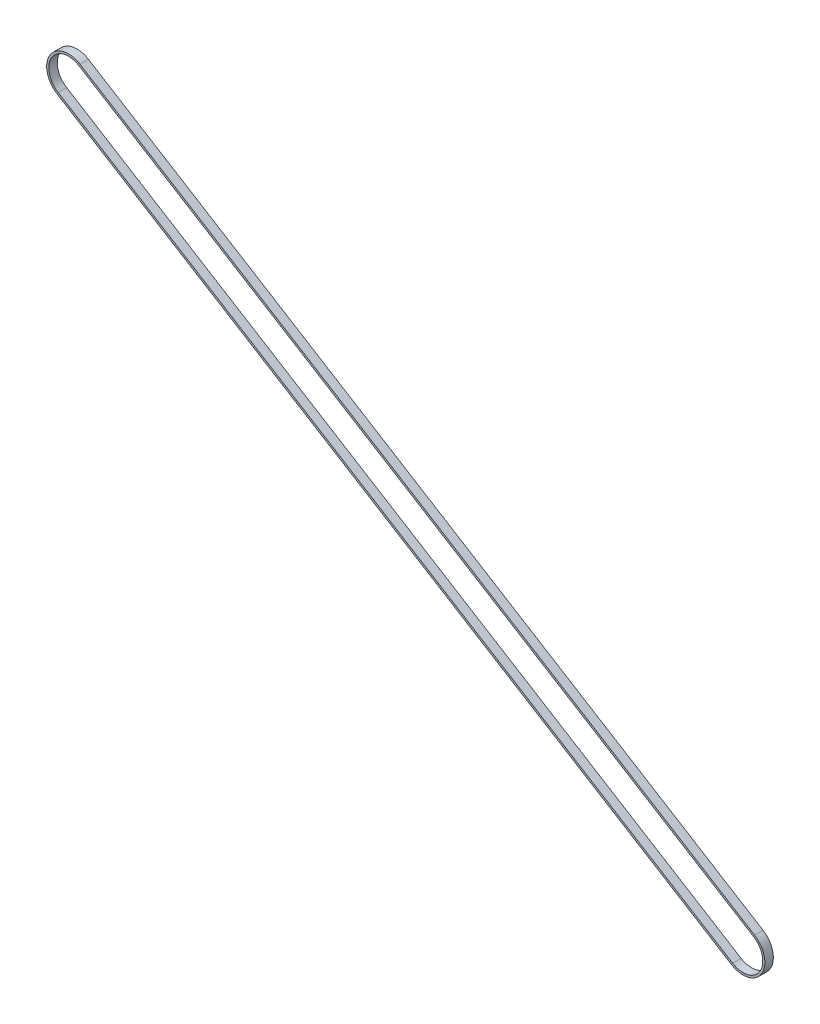
ISO-10303-21;
HEADER;
FILE_DESCRIPTION(('STEP AP214'),'2;1');
FILE_NAME('part.step','',(''),(''),'','','');
FILE_SCHEMA(('AUTOMOTIVE_DESIGN { 1 0 10303 214 1 1 1 1 }'));
ENDSEC;
DATA;
#1=APPLICATION_CONTEXT('core data for automotive mechanical design processes');
#2=APPLICATION_PROTOCOL_DEFINITION('international standard','automotive_design',2000,#1);
#3=PRODUCT_CONTEXT('',#1,'mechanical');
#4=PRODUCT('Part','Part','',(#3));
#5=PRODUCT_RELATED_PRODUCT_CATEGORY('part','',(#4));
#6=PRODUCT_DEFINITION_FORMATION('','',#4);
#7=PRODUCT_DEFINITION_CONTEXT('part definition',#1,'design');
#8=PRODUCT_DEFINITION('design','',#6,#7);
#9=PRODUCT_DEFINITION_SHAPE('','',#8);
#10=(LENGTH_UNIT() NAMED_UNIT(*) SI_UNIT(.MILLI.,.METRE.));
#11=(NAMED_UNIT(*) PLANE_ANGLE_UNIT() SI_UNIT($,.RADIAN.));
#12=(NAMED_UNIT(*) SI_UNIT($,.STERADIAN.) SOLID_ANGLE_UNIT());
#13=UNCERTAINTY_MEASURE_WITH_UNIT(LENGTH_MEASURE(1.E-05),#10,'distance_accuracy_value','');
#14=(GEOMETRIC_REPRESENTATION_CONTEXT(3) GLOBAL_UNCERTAINTY_ASSIGNED_CONTEXT((#13)) GLOBAL_UNIT_ASSIGNED_CONTEXT((#10,
#11,#12)) REPRESENTATION_CONTEXT('',''));
#15=CARTESIAN_POINT('',(0.,0.,0.));
#16=DIRECTION('',(0.,0.,1.));
#17=DIRECTION('',(1.,0.,0.));
#18=AXIS2_PLACEMENT_3D('',#15,#16,#17);
#19=CARTESIAN_POINT('',(-477.919408312635,295.355297509359,6.));
#20=DIRECTION('',(0.,0.,-1.));
#21=DIRECTION('',(-1.,0.,0.));
#22=AXIS2_PLACEMENT_3D('',#19,#20,#21);
#23=CYLINDRICAL_SURFACE('',#22,15.475);
#24=CARTESIAN_POINT('',(-477.919408312635,295.355297509359,0.));
#25=DIRECTION('',(0.,0.,-1.));
#26=DIRECTION('',(-1.,0.,0.));
#27=AXIS2_PLACEMENT_3D('',#24,#25,#26);
#28=CIRCLE('',#27,15.475);
#29=CARTESIAN_POINT('',(-486.054795496159,282.191289746746,0.));
#30=VERTEX_POINT('',#29);
#31=CARTESIAN_POINT('',(-469.78402112911,308.519305271972,0.));
#32=VERTEX_POINT('',#31);
#33=EDGE_CURVE('E159',#30,#32,#28,.T.);
#34=ORIENTED_EDGE('',*,*,#33,.F.);
#35=DIRECTION('',(0.,0.,-1.));
#36=VECTOR('',#35,1.);
#37=CARTESIAN_POINT('',(-486.054795496159,282.191289746746,6.));
#38=LINE('',#37,#36);
#39=CARTESIAN_POINT('',(-486.054795496159,282.191289746746,6.));
#40=VERTEX_POINT('',#39);
#41=EDGE_CURVE('E12',#40,#30,#38,.T.);
#42=ORIENTED_EDGE('',*,*,#41,.F.);
#43=CARTESIAN_POINT('',(-477.919408312635,295.355297509359,6.));
#44=DIRECTION('',(0.,0.,-1.));
#45=DIRECTION('',(-1.,0.,0.));
#46=AXIS2_PLACEMENT_3D('',#43,#44,#45);
#47=CIRCLE('',#46,15.475);
#48=CARTESIAN_POINT('',(-469.78402112911,308.519305271972,6.));
#49=VERTEX_POINT('',#48);
#50=EDGE_CURVE('E163',#40,#49,#47,.T.);
#51=ORIENTED_EDGE('',*,*,#50,.T.);
#52=DIRECTION('',(0.,0.,-1.));
#53=VECTOR('',#52,1.);
#54=CARTESIAN_POINT('',(-469.78402112911,308.519305271972,6.));
#55=LINE('',#54,#53);
#56=EDGE_CURVE('E64',#49,#32,#55,.T.);
#57=ORIENTED_EDGE('',*,*,#56,.T.);
#58=EDGE_LOOP('',(#34,#42,#51,#57));
#59=FACE_BOUND('',#58,.T.);
#60=ADVANCED_FACE('F61',(#59),#23,.T.);
#61=CARTESIAN_POINT('',(-486.054795496159,282.191289746746,6.));
#62=DIRECTION('',(-0.525711611213227,-0.8506628602658,0.));
#63=DIRECTION('',(0.850662860265801,-0.525711611213227,0.));
#64=AXIS2_PLACEMENT_3D('',#61,#62,#63);
#65=PLANE('',#64);
#66=DIRECTION('',(-0.850662860265801,0.525711611213227,0.));
#67=VECTOR('',#66,1.);
#68=CARTESIAN_POINT('',(-486.054795496159,282.191289746746,0.));
#69=LINE('',#68,#67);
#70=CARTESIAN_POINT('',(-8.13538718354534,-13.1640077627645,0.));
#71=VERTEX_POINT('',#70);
#72=EDGE_CURVE('E167',#71,#30,#69,.T.);
#73=ORIENTED_EDGE('',*,*,#72,.F.);
#74=DIRECTION('',(0.,0.,-1.));
#75=VECTOR('',#74,1.);
#76=CARTESIAN_POINT('',(-8.13538718354534,-13.1640077627645,6.));
#77=LINE('',#76,#75);
#78=CARTESIAN_POINT('',(-8.13538718354534,-13.1640077627645,6.));
#79=VERTEX_POINT('',#78);
#80=EDGE_CURVE('E69',#79,#71,#77,.T.);
#81=ORIENTED_EDGE('',*,*,#80,.F.);
#82=DIRECTION('',(-0.850662860265801,0.525711611213227,0.));
#83=VECTOR('',#82,1.);
#84=CARTESIAN_POINT('',(-486.054795496159,282.191289746746,6.));
#85=LINE('',#84,#83);
#86=EDGE_CURVE('E173',#79,#40,#85,.T.);
#87=ORIENTED_EDGE('',*,*,#86,.T.);
#88=ORIENTED_EDGE('',*,*,#41,.T.);
#89=EDGE_LOOP('',(#73,#81,#87,#88));
#90=FACE_BOUND('',#89,.T.);
#91=ADVANCED_FACE('F199',(#90),#65,.T.);
#92=CARTESIAN_POINT('',(-2.06501482580279E-11,-1.51267887105178E-10,6.));
#93=DIRECTION('',(0.,0.,-1.));
#94=DIRECTION('',(-1.,0.,0.));
#95=AXIS2_PLACEMENT_3D('',#92,#93,#94);
#96=CYLINDRICAL_SURFACE('',#95,15.475);
#97=CARTESIAN_POINT('',(-2.06501482580279E-11,-1.51267887105178E-10,0.));
#98=DIRECTION('',(0.,0.,-1.));
#99=DIRECTION('',(-1.,0.,0.));
#100=AXIS2_PLACEMENT_3D('',#97,#98,#99);
#101=CIRCLE('',#100,15.475);
#102=CARTESIAN_POINT('',(8.1353871835041,13.164007762462,0.));
#103=VERTEX_POINT('',#102);
#104=EDGE_CURVE('E181',#103,#71,#101,.T.);
#105=ORIENTED_EDGE('',*,*,#104,.F.);
#106=DIRECTION('',(0.,0.,-1.));
#107=VECTOR('',#106,1.);
#108=CARTESIAN_POINT('',(8.1353871835041,13.164007762462,6.));
#109=LINE('',#108,#107);
#110=CARTESIAN_POINT('',(8.1353871835041,13.164007762462,6.));
#111=VERTEX_POINT('',#110);
#112=EDGE_CURVE('E186',#111,#103,#109,.T.);
#113=ORIENTED_EDGE('',*,*,#112,.F.);
#114=CARTESIAN_POINT('',(-2.06501482580279E-11,-1.51267887105178E-10,6.));
#115=DIRECTION('',(0.,0.,-1.));
#116=DIRECTION('',(-1.,0.,0.));
#117=AXIS2_PLACEMENT_3D('',#114,#115,#116);
#118=CIRCLE('',#117,15.475);
#119=EDGE_CURVE('E170',#111,#79,#118,.T.);
#120=ORIENTED_EDGE('',*,*,#119,.T.);
#121=ORIENTED_EDGE('',*,*,#80,.T.);
#122=EDGE_LOOP('',(#105,#113,#120,#121));
#123=FACE_BOUND('',#122,.T.);
#124=ADVANCED_FACE('F203',(#123),#96,.T.);
#125=CARTESIAN_POINT('',(-469.78402112911,308.519305271972,6.));
#126=DIRECTION('',(0.525711611213227,0.8506628602658,0.));
#127=DIRECTION('',(-0.850662860265801,0.525711611213227,0.));
#128=AXIS2_PLACEMENT_3D('',#125,#126,#127);
#129=PLANE('',#128);
#130=DIRECTION('',(0.850662860265801,-0.525711611213227,0.));
#131=VECTOR('',#130,1.);
#132=CARTESIAN_POINT('',(-469.78402112911,308.519305271972,0.));
#133=LINE('',#132,#131);
#134=EDGE_CURVE('E178',#32,#103,#133,.T.);
#135=ORIENTED_EDGE('',*,*,#134,.F.);
#136=ORIENTED_EDGE('',*,*,#56,.F.);
#137=DIRECTION('',(0.850662860265801,-0.525711611213227,0.));
#138=VECTOR('',#137,1.);
#139=CARTESIAN_POINT('',(-469.78402112911,308.519305271972,6.));
#140=LINE('',#139,#138);
#141=EDGE_CURVE('E166',#49,#111,#140,.T.);
#142=ORIENTED_EDGE('',*,*,#141,.T.);
#143=ORIENTED_EDGE('',*,*,#112,.T.);
#144=EDGE_LOOP('',(#135,#136,#142,#143));
#145=FACE_BOUND('',#144,.T.);
#146=ADVANCED_FACE('F194',(#145),#129,.T.);
#147=CARTESIAN_POINT('',(-477.919408312635,295.355297509359,6.));
#148=DIRECTION('',(0.,0.,-1.));
#149=DIRECTION('',(-1.,0.,0.));
#150=AXIS2_PLACEMENT_3D('',#147,#148,#149);
#151=PLANE('',#150);
#152=DIRECTION('',(-0.8506628602658,0.525711611213227,0.));
#153=VECTOR('',#152,1.);
#154=CARTESIAN_POINT('',(-7.3468197667255,-11.8880134723658,6.));
#155=LINE('',#154,#153);
#156=CARTESIAN_POINT('',(-7.3468197667255,-11.8880134723658,6.));
#157=VERTEX_POINT('',#156);
#158=CARTESIAN_POINT('',(-485.266228079339,283.467284037144,6.));
#159=VERTEX_POINT('',#158);
#160=EDGE_CURVE('E134',#157,#159,#155,.T.);
#161=ORIENTED_EDGE('',*,*,#160,.T.);
#162=CARTESIAN_POINT('',(-477.919408312635,295.355297509359,6.));
#163=DIRECTION('',(0.,0.,-1.));
#164=DIRECTION('',(-1.,0.,0.));
#165=AXIS2_PLACEMENT_3D('',#162,#163,#164);
#166=CIRCLE('',#165,13.975);
#167=CARTESIAN_POINT('',(-470.57258854593,307.243310981574,6.));
#168=VERTEX_POINT('',#167);
#169=EDGE_CURVE('E128',#159,#168,#166,.T.);
#170=ORIENTED_EDGE('',*,*,#169,.T.);
#171=DIRECTION('',(0.8506628602658,-0.525711611213227,0.));
#172=VECTOR('',#171,1.);
#173=CARTESIAN_POINT('',(-470.57258854593,307.243310981574,6.));
#174=LINE('',#173,#172);
#175=CARTESIAN_POINT('',(7.34681976668417,11.8880134720633,6.));
#176=VERTEX_POINT('',#175);
#177=EDGE_CURVE('E137',#168,#176,#174,.T.);
#178=ORIENTED_EDGE('',*,*,#177,.T.);
#179=CARTESIAN_POINT('',(-2.06501482580279E-11,-1.51267887105178E-10,6.));
#180=DIRECTION('',(0.,0.,-1.));
#181=DIRECTION('',(-1.,0.,0.));
#182=AXIS2_PLACEMENT_3D('',#179,#180,#181);
#183=CIRCLE('',#182,13.975);
#184=EDGE_CURVE('E77',#176,#157,#183,.T.);
#185=ORIENTED_EDGE('',*,*,#184,.T.);
#186=EDGE_LOOP('',(#161,#170,#178,#185));
#187=FACE_BOUND('',#186,.T.);
#188=ORIENTED_EDGE('',*,*,#50,.F.);
#189=ORIENTED_EDGE('',*,*,#86,.F.);
#190=ORIENTED_EDGE('',*,*,#119,.F.);
#191=ORIENTED_EDGE('',*,*,#141,.F.);
#192=EDGE_LOOP('',(#188,#189,#190,#191));
#193=FACE_BOUND('',#192,.T.);
#194=ADVANCED_FACE('F141',(#187,#193),#151,.F.);
#195=CARTESIAN_POINT('',(-477.919408312635,295.355297509359,0.));
#196=DIRECTION('',(0.,0.,-1.));
#197=DIRECTION('',(-1.,0.,0.));
#198=AXIS2_PLACEMENT_3D('',#195,#196,#197);
#199=PLANE('',#198);
#200=CARTESIAN_POINT('',(-477.919408312635,295.355297509359,0.));
#201=DIRECTION('',(0.,0.,-1.));
#202=DIRECTION('',(-1.,0.,0.));
#203=AXIS2_PLACEMENT_3D('',#200,#201,#202);
#204=CIRCLE('',#203,13.975);
#205=CARTESIAN_POINT('',(-485.266228079339,283.467284037144,0.));
#206=VERTEX_POINT('',#205);
#207=CARTESIAN_POINT('',(-470.57258854593,307.243310981574,0.));
#208=VERTEX_POINT('',#207);
#209=EDGE_CURVE('E85',#206,#208,#204,.T.);
#210=ORIENTED_EDGE('',*,*,#209,.F.);
#211=DIRECTION('',(-0.8506628602658,0.525711611213227,0.));
#212=VECTOR('',#211,1.);
#213=CARTESIAN_POINT('',(-7.3468197667255,-11.8880134723658,0.));
#214=LINE('',#213,#212);
#215=CARTESIAN_POINT('',(-7.3468197667255,-11.8880134723658,0.));
#216=VERTEX_POINT('',#215);
#217=EDGE_CURVE('E144',#216,#206,#214,.T.);
#218=ORIENTED_EDGE('',*,*,#217,.F.);
#219=CARTESIAN_POINT('',(-2.06501482580279E-11,-1.51267887105178E-10,0.));
#220=DIRECTION('',(0.,0.,-1.));
#221=DIRECTION('',(-1.,0.,0.));
#222=AXIS2_PLACEMENT_3D('',#219,#220,#221);
#223=CIRCLE('',#222,13.975);
#224=CARTESIAN_POINT('',(7.3468197666842,11.8880134720633,0.));
#225=VERTEX_POINT('',#224);
#226=EDGE_CURVE('E147',#225,#216,#223,.T.);
#227=ORIENTED_EDGE('',*,*,#226,.F.);
#228=DIRECTION('',(0.8506628602658,-0.525711611213227,0.));
#229=VECTOR('',#228,1.);
#230=CARTESIAN_POINT('',(-470.57258854593,307.243310981574,0.));
#231=LINE('',#230,#229);
#232=EDGE_CURVE('E153',#208,#225,#231,.T.);
#233=ORIENTED_EDGE('',*,*,#232,.F.);
#234=EDGE_LOOP('',(#210,#218,#227,#233));
#235=FACE_BOUND('',#234,.T.);
#236=ORIENTED_EDGE('',*,*,#33,.T.);
#237=ORIENTED_EDGE('',*,*,#134,.T.);
#238=ORIENTED_EDGE('',*,*,#104,.T.);
#239=ORIENTED_EDGE('',*,*,#72,.T.);
#240=EDGE_LOOP('',(#236,#237,#238,#239));
#241=FACE_BOUND('',#240,.T.);
#242=ADVANCED_FACE('F196',(#235,#241),#199,.T.);
#243=CARTESIAN_POINT('',(-477.919408312635,295.355297509359,6.));
#244=DIRECTION('',(0.,0.,-1.));
#245=DIRECTION('',(-1.,0.,0.));
#246=AXIS2_PLACEMENT_3D('',#243,#244,#245);
#247=CYLINDRICAL_SURFACE('',#246,13.975);
#248=ORIENTED_EDGE('',*,*,#209,.T.);
#249=DIRECTION('',(0.,0.,-1.));
#250=VECTOR('',#249,1.);
#251=CARTESIAN_POINT('',(-470.57258854593,307.243310981574,6.));
#252=LINE('',#251,#250);
#253=EDGE_CURVE('E124',#168,#208,#252,.T.);
#254=ORIENTED_EDGE('',*,*,#253,.F.);
#255=ORIENTED_EDGE('',*,*,#169,.F.);
#256=DIRECTION('',(0.,0.,-1.));
#257=VECTOR('',#256,1.);
#258=CARTESIAN_POINT('',(-485.266228079339,283.467284037144,6.));
#259=LINE('',#258,#257);
#260=EDGE_CURVE('E157',#159,#206,#259,.T.);
#261=ORIENTED_EDGE('',*,*,#260,.T.);
#262=EDGE_LOOP('',(#248,#254,#255,#261));
#263=FACE_BOUND('',#262,.T.);
#264=ADVANCED_FACE('F126',(#263),#247,.F.);
#265=CARTESIAN_POINT('',(-7.3468197667255,-11.8880134723658,6.));
#266=DIRECTION('',(-0.525711611213227,-0.850662860265801,0.));
#267=DIRECTION('',(0.850662860265801,-0.525711611213227,0.));
#268=AXIS2_PLACEMENT_3D('',#265,#266,#267);
#269=PLANE('',#268);
#270=ORIENTED_EDGE('',*,*,#217,.T.);
#271=ORIENTED_EDGE('',*,*,#260,.F.);
#272=ORIENTED_EDGE('',*,*,#160,.F.);
#273=DIRECTION('',(0.,0.,-1.));
#274=VECTOR('',#273,1.);
#275=CARTESIAN_POINT('',(-7.3468197667255,-11.8880134723658,6.));
#276=LINE('',#275,#274);
#277=EDGE_CURVE('E160',#157,#216,#276,.T.);
#278=ORIENTED_EDGE('',*,*,#277,.T.);
#279=EDGE_LOOP('',(#270,#271,#272,#278));
#280=FACE_BOUND('',#279,.T.);
#281=ADVANCED_FACE('F254',(#280),#269,.F.);
#282=CARTESIAN_POINT('',(-2.06501482580279E-11,-1.51267887105178E-10,6.));
#283=DIRECTION('',(0.,0.,-1.));
#284=DIRECTION('',(-1.,0.,0.));
#285=AXIS2_PLACEMENT_3D('',#282,#283,#284);
#286=CYLINDRICAL_SURFACE('',#285,13.975);
#287=ORIENTED_EDGE('',*,*,#226,.T.);
#288=ORIENTED_EDGE('',*,*,#277,.F.);
#289=ORIENTED_EDGE('',*,*,#184,.F.);
#290=DIRECTION('',(0.,0.,-1.));
#291=VECTOR('',#290,1.);
#292=CARTESIAN_POINT('',(7.3468197666842,11.8880134720633,6.));
#293=LINE('',#292,#291);
#294=EDGE_CURVE('E133',#176,#225,#293,.T.);
#295=ORIENTED_EDGE('',*,*,#294,.T.);
#296=EDGE_LOOP('',(#287,#288,#289,#295));
#297=FACE_BOUND('',#296,.T.);
#298=ADVANCED_FACE('F263',(#297),#286,.F.);
#299=CARTESIAN_POINT('',(-470.57258854593,307.243310981574,6.));
#300=DIRECTION('',(0.525711611213227,0.850662860265801,0.));
#301=DIRECTION('',(-0.850662860265801,0.525711611213227,0.));
#302=AXIS2_PLACEMENT_3D('',#299,#300,#301);
#303=PLANE('',#302);
#304=ORIENTED_EDGE('',*,*,#232,.T.);
#305=ORIENTED_EDGE('',*,*,#294,.F.);
#306=ORIENTED_EDGE('',*,*,#177,.F.);
#307=ORIENTED_EDGE('',*,*,#253,.T.);
#308=EDGE_LOOP('',(#304,#305,#306,#307));
#309=FACE_BOUND('',#308,.T.);
#310=ADVANCED_FACE('F138',(#309),#303,.F.);
#311=CLOSED_SHELL('',(#60,#91,#124,#146,#194,#242,#264,#281,#298,#310));
#312=MANIFOLD_SOLID_BREP('B2',#311);
#313=ADVANCED_BREP_SHAPE_REPRESENTATION('',(#18,#312),#14);
#314=SHAPE_DEFINITION_REPRESENTATION(#9,#313);
ENDSEC;
END-ISO-10303-21;
